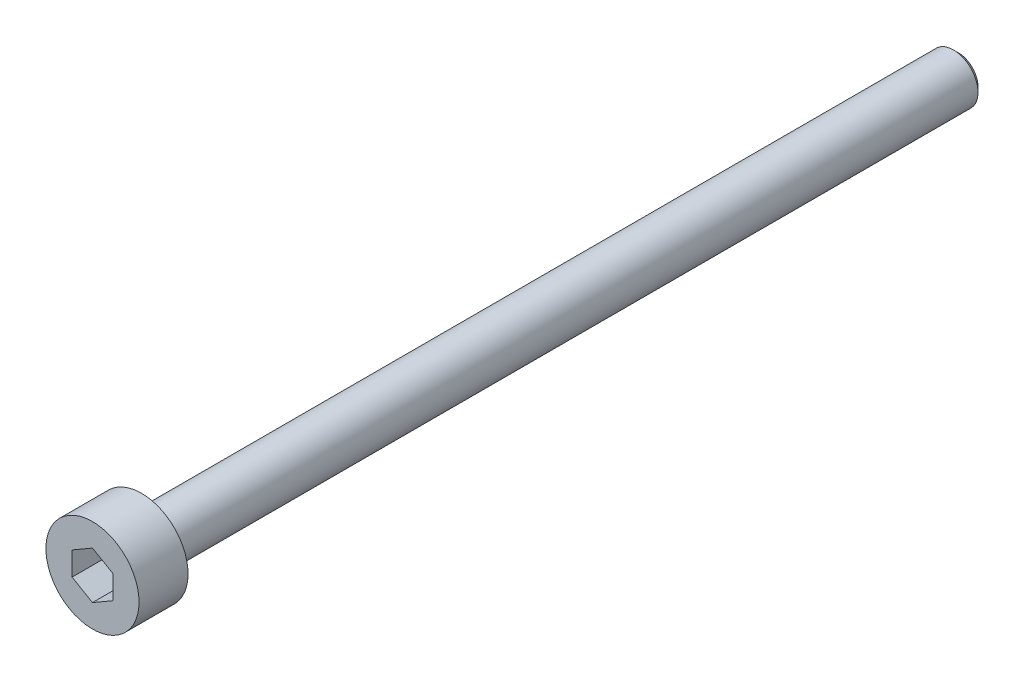
ISO-10303-21;
HEADER;
FILE_DESCRIPTION(('STEP AP214'),'2;1');
FILE_NAME('part.step','',(''),(''),'','','');
FILE_SCHEMA(('AUTOMOTIVE_DESIGN { 1 0 10303 214 1 1 1 1 }'));
ENDSEC;
DATA;
#1=APPLICATION_CONTEXT('core data for automotive mechanical design processes');
#2=APPLICATION_PROTOCOL_DEFINITION('international standard','automotive_design',2000,#1);
#3=PRODUCT_CONTEXT('',#1,'mechanical');
#4=PRODUCT('Part','Part','',(#3));
#5=PRODUCT_RELATED_PRODUCT_CATEGORY('part','',(#4));
#6=PRODUCT_DEFINITION_FORMATION('','',#4);
#7=PRODUCT_DEFINITION_CONTEXT('part definition',#1,'design');
#8=PRODUCT_DEFINITION('design','',#6,#7);
#9=PRODUCT_DEFINITION_SHAPE('','',#8);
#10=(LENGTH_UNIT() NAMED_UNIT(*) SI_UNIT(.MILLI.,.METRE.));
#11=(NAMED_UNIT(*) PLANE_ANGLE_UNIT() SI_UNIT($,.RADIAN.));
#12=(NAMED_UNIT(*) SI_UNIT($,.STERADIAN.) SOLID_ANGLE_UNIT());
#13=UNCERTAINTY_MEASURE_WITH_UNIT(LENGTH_MEASURE(1.E-05),#10,'distance_accuracy_value','');
#14=(GEOMETRIC_REPRESENTATION_CONTEXT(3) GLOBAL_UNCERTAINTY_ASSIGNED_CONTEXT((#13)) GLOBAL_UNIT_ASSIGNED_CONTEXT((#10,
#11,#12)) REPRESENTATION_CONTEXT('',''));
#15=CARTESIAN_POINT('',(0.,0.,0.));
#16=DIRECTION('',(0.,0.,1.));
#17=DIRECTION('',(1.,0.,0.));
#18=AXIS2_PLACEMENT_3D('',#15,#16,#17);
#19=CARTESIAN_POINT('',(0.,0.,0.));
#20=DIRECTION('',(0.,0.,1.));
#21=DIRECTION('',(1.,0.,0.));
#22=AXIS2_PLACEMENT_3D('',#19,#20,#21);
#23=PLANE('',#22);
#24=CARTESIAN_POINT('',(0.,0.,0.));
#25=DIRECTION('',(0.,0.,1.));
#26=DIRECTION('',(1.,0.,0.));
#27=AXIS2_PLACEMENT_3D('',#24,#25,#26);
#28=CIRCLE('',#27,2.85);
#29=CARTESIAN_POINT('',(2.85,0.,0.));
#30=VERTEX_POINT('',#29);
#31=EDGE_CURVE('E137',#30,#30,#28,.T.);
#32=ORIENTED_EDGE('',*,*,#31,.F.);
#33=EDGE_LOOP('',(#32));
#34=FACE_BOUND('',#33,.T.);
#35=CARTESIAN_POINT('',(0.,0.,0.));
#36=DIRECTION('',(0.,0.,1.));
#37=DIRECTION('',(1.,0.,0.));
#38=AXIS2_PLACEMENT_3D('',#35,#36,#37);
#39=CIRCLE('',#38,1.5);
#40=CARTESIAN_POINT('',(1.5,0.,0.));
#41=VERTEX_POINT('',#40);
#42=EDGE_CURVE('E146',#41,#41,#39,.F.);
#43=ORIENTED_EDGE('',*,*,#42,.F.);
#44=EDGE_LOOP('',(#43));
#45=FACE_BOUND('',#44,.T.);
#46=ADVANCED_FACE('F35',(#34,#45),#23,.F.);
#47=CARTESIAN_POINT('',(0.,0.,3.));
#48=DIRECTION('',(0.,0.,-1.));
#49=DIRECTION('',(-1.,0.,0.));
#50=AXIS2_PLACEMENT_3D('',#47,#48,#49);
#51=CYLINDRICAL_SURFACE('',#50,2.85);
#52=CARTESIAN_POINT('',(0.,0.,3.));
#53=DIRECTION('',(0.,0.,1.));
#54=DIRECTION('',(1.,0.,0.));
#55=AXIS2_PLACEMENT_3D('',#52,#53,#54);
#56=CIRCLE('',#55,2.85);
#57=CARTESIAN_POINT('',(2.85,0.,3.));
#58=VERTEX_POINT('',#57);
#59=EDGE_CURVE('E143',#58,#58,#56,.T.);
#60=ORIENTED_EDGE('',*,*,#59,.F.);
#61=EDGE_LOOP('',(#60));
#62=FACE_BOUND('',#61,.T.);
#63=ORIENTED_EDGE('',*,*,#31,.T.);
#64=EDGE_LOOP('',(#63));
#65=FACE_BOUND('',#64,.T.);
#66=ADVANCED_FACE('F168',(#62,#65),#51,.T.);
#67=CARTESIAN_POINT('',(0.,0.,3.));
#68=DIRECTION('',(0.,0.,1.));
#69=DIRECTION('',(1.,0.,0.));
#70=AXIS2_PLACEMENT_3D('',#67,#68,#69);
#71=PLANE('',#70);
#72=DIRECTION('',(-0.866025403784439,0.5,0.));
#73=VECTOR('',#72,1.);
#74=CARTESIAN_POINT('',(1.25,0.721687836487032,3.));
#75=LINE('',#74,#73);
#76=CARTESIAN_POINT('',(1.25,0.721687836487032,3.));
#77=VERTEX_POINT('',#76);
#78=CARTESIAN_POINT('',(0.,1.44337567297406,3.));
#79=VERTEX_POINT('',#78);
#80=EDGE_CURVE('E50',#77,#79,#75,.T.);
#81=ORIENTED_EDGE('',*,*,#80,.F.);
#82=DIRECTION('',(0.,1.,0.));
#83=VECTOR('',#82,1.);
#84=CARTESIAN_POINT('',(1.25,-0.721687836487032,3.));
#85=LINE('',#84,#83);
#86=CARTESIAN_POINT('',(1.25,-0.721687836487032,3.));
#87=VERTEX_POINT('',#86);
#88=EDGE_CURVE('E133',#87,#77,#85,.T.);
#89=ORIENTED_EDGE('',*,*,#88,.F.);
#90=DIRECTION('',(0.866025403784439,0.5,0.));
#91=VECTOR('',#90,1.);
#92=CARTESIAN_POINT('',(0.,-1.44337567297406,3.));
#93=LINE('',#92,#91);
#94=CARTESIAN_POINT('',(0.,-1.44337567297406,3.));
#95=VERTEX_POINT('',#94);
#96=EDGE_CURVE('E131',#95,#87,#93,.T.);
#97=ORIENTED_EDGE('',*,*,#96,.F.);
#98=DIRECTION('',(0.866025403784439,-0.5,0.));
#99=VECTOR('',#98,1.);
#100=CARTESIAN_POINT('',(-1.25,-0.721687836487033,3.));
#101=LINE('',#100,#99);
#102=CARTESIAN_POINT('',(-1.25,-0.721687836487033,3.));
#103=VERTEX_POINT('',#102);
#104=EDGE_CURVE('E98',#103,#95,#101,.T.);
#105=ORIENTED_EDGE('',*,*,#104,.F.);
#106=DIRECTION('',(0.,-1.,0.));
#107=VECTOR('',#106,1.);
#108=CARTESIAN_POINT('',(-1.25,0.721687836487032,3.));
#109=LINE('',#108,#107);
#110=CARTESIAN_POINT('',(-1.25,0.721687836487032,3.));
#111=VERTEX_POINT('',#110);
#112=EDGE_CURVE('E127',#111,#103,#109,.T.);
#113=ORIENTED_EDGE('',*,*,#112,.F.);
#114=DIRECTION('',(-0.866025403784439,-0.5,0.));
#115=VECTOR('',#114,1.);
#116=CARTESIAN_POINT('',(0.,1.44337567297406,3.));
#117=LINE('',#116,#115);
#118=EDGE_CURVE('E124',#79,#111,#117,.T.);
#119=ORIENTED_EDGE('',*,*,#118,.F.);
#120=EDGE_LOOP('',(#81,#89,#97,#105,#113,#119));
#121=FACE_BOUND('',#120,.T.);
#122=ORIENTED_EDGE('',*,*,#59,.T.);
#123=EDGE_LOOP('',(#122));
#124=FACE_BOUND('',#123,.T.);
#125=ADVANCED_FACE('F174',(#121,#124),#71,.T.);
#126=CARTESIAN_POINT('',(0.,0.,-50.));
#127=DIRECTION('',(0.,0.,1.));
#128=DIRECTION('',(1.,0.,0.));
#129=AXIS2_PLACEMENT_3D('',#126,#127,#128);
#130=CYLINDRICAL_SURFACE('',#129,1.5);
#131=CARTESIAN_POINT('',(0.,0.,-49.7));
#132=DIRECTION('',(0.,0.,-1.));
#133=DIRECTION('',(-1.,0.,0.));
#134=AXIS2_PLACEMENT_3D('',#131,#132,#133);
#135=CIRCLE('',#134,1.5);
#136=CARTESIAN_POINT('',(-1.5,0.,-49.7));
#137=VERTEX_POINT('',#136);
#138=EDGE_CURVE('E11',#137,#137,#135,.F.);
#139=ORIENTED_EDGE('',*,*,#138,.T.);
#140=EDGE_LOOP('',(#139));
#141=FACE_BOUND('',#140,.T.);
#142=ORIENTED_EDGE('',*,*,#42,.T.);
#143=EDGE_LOOP('',(#142));
#144=FACE_BOUND('',#143,.T.);
#145=ADVANCED_FACE('F164',(#141,#144),#130,.T.);
#146=CARTESIAN_POINT('',(0.,0.,-50.));
#147=DIRECTION('',(0.,0.,-1.));
#148=DIRECTION('',(-1.,0.,0.));
#149=AXIS2_PLACEMENT_3D('',#146,#147,#148);
#150=PLANE('',#149);
#151=CARTESIAN_POINT('',(0.,0.,-50.));
#152=DIRECTION('',(0.,0.,-1.));
#153=DIRECTION('',(-1.,0.,0.));
#154=AXIS2_PLACEMENT_3D('',#151,#152,#153);
#155=CIRCLE('',#154,1.2);
#156=CARTESIAN_POINT('',(-1.2,0.,-50.));
#157=VERTEX_POINT('',#156);
#158=EDGE_CURVE('E43',#157,#157,#155,.T.);
#159=ORIENTED_EDGE('',*,*,#158,.T.);
#160=EDGE_LOOP('',(#159));
#161=FACE_BOUND('',#160,.T.);
#162=ADVANCED_FACE('F153',(#161),#150,.T.);
#163=CARTESIAN_POINT('',(0.,0.,-50.));
#164=DIRECTION('',(0.,0.,1.));
#165=DIRECTION('',(1.,0.,0.));
#166=AXIS2_PLACEMENT_3D('',#163,#164,#165);
#167=CONICAL_SURFACE('',#166,1.2,0.785398163397447);
#168=ORIENTED_EDGE('',*,*,#138,.F.);
#169=EDGE_LOOP('',(#168));
#170=FACE_BOUND('',#169,.T.);
#171=ORIENTED_EDGE('',*,*,#158,.F.);
#172=EDGE_LOOP('',(#171));
#173=FACE_BOUND('',#172,.T.);
#174=ADVANCED_FACE('F37',(#170,#173),#167,.T.);
#175=CARTESIAN_POINT('',(1.25,0.721687836487032,1.));
#176=DIRECTION('',(0.5,0.866025403784439,0.));
#177=DIRECTION('',(-0.866025403784439,0.5,0.));
#178=AXIS2_PLACEMENT_3D('',#175,#176,#177);
#179=PLANE('',#178);
#180=ORIENTED_EDGE('',*,*,#80,.T.);
#181=DIRECTION('',(0.,0.,1.));
#182=VECTOR('',#181,1.);
#183=CARTESIAN_POINT('',(0.,1.44337567297406,1.));
#184=LINE('',#183,#182);
#185=CARTESIAN_POINT('',(0.,1.44337567297406,1.));
#186=VERTEX_POINT('',#185);
#187=EDGE_CURVE('E80',#186,#79,#184,.T.);
#188=ORIENTED_EDGE('',*,*,#187,.F.);
#189=DIRECTION('',(-0.866025403784439,0.5,0.));
#190=VECTOR('',#189,1.);
#191=CARTESIAN_POINT('',(1.25,0.721687836487032,1.));
#192=LINE('',#191,#190);
#193=CARTESIAN_POINT('',(1.25,0.721687836487032,1.));
#194=VERTEX_POINT('',#193);
#195=EDGE_CURVE('E135',#194,#186,#192,.T.);
#196=ORIENTED_EDGE('',*,*,#195,.F.);
#197=DIRECTION('',(0.,0.,1.));
#198=VECTOR('',#197,1.);
#199=CARTESIAN_POINT('',(1.25,0.721687836487032,1.));
#200=LINE('',#199,#198);
#201=EDGE_CURVE('E58',#194,#77,#200,.T.);
#202=ORIENTED_EDGE('',*,*,#201,.T.);
#203=EDGE_LOOP('',(#180,#188,#196,#202));
#204=FACE_BOUND('',#203,.T.);
#205=ADVANCED_FACE('F156',(#204),#179,.F.);
#206=CARTESIAN_POINT('',(1.25,-0.721687836487032,1.));
#207=DIRECTION('',(1.,0.,0.));
#208=DIRECTION('',(0.,1.,0.));
#209=AXIS2_PLACEMENT_3D('',#206,#207,#208);
#210=PLANE('',#209);
#211=ORIENTED_EDGE('',*,*,#88,.T.);
#212=ORIENTED_EDGE('',*,*,#201,.F.);
#213=DIRECTION('',(0.,1.,0.));
#214=VECTOR('',#213,1.);
#215=CARTESIAN_POINT('',(1.25,-0.721687836487032,1.));
#216=LINE('',#215,#214);
#217=CARTESIAN_POINT('',(1.25,-0.721687836487032,1.));
#218=VERTEX_POINT('',#217);
#219=EDGE_CURVE('E110',#218,#194,#216,.T.);
#220=ORIENTED_EDGE('',*,*,#219,.F.);
#221=DIRECTION('',(0.,0.,1.));
#222=VECTOR('',#221,1.);
#223=CARTESIAN_POINT('',(1.25,-0.721687836487032,1.));
#224=LINE('',#223,#222);
#225=EDGE_CURVE('E102',#218,#87,#224,.T.);
#226=ORIENTED_EDGE('',*,*,#225,.T.);
#227=EDGE_LOOP('',(#211,#212,#220,#226));
#228=FACE_BOUND('',#227,.T.);
#229=ADVANCED_FACE('F162',(#228),#210,.F.);
#230=CARTESIAN_POINT('',(0.,-1.44337567297406,1.));
#231=DIRECTION('',(0.5,-0.866025403784439,0.));
#232=DIRECTION('',(0.866025403784439,0.5,0.));
#233=AXIS2_PLACEMENT_3D('',#230,#231,#232);
#234=PLANE('',#233);
#235=ORIENTED_EDGE('',*,*,#96,.T.);
#236=ORIENTED_EDGE('',*,*,#225,.F.);
#237=DIRECTION('',(0.866025403784439,0.5,0.));
#238=VECTOR('',#237,1.);
#239=CARTESIAN_POINT('',(0.,-1.44337567297406,1.));
#240=LINE('',#239,#238);
#241=CARTESIAN_POINT('',(0.,-1.44337567297406,1.));
#242=VERTEX_POINT('',#241);
#243=EDGE_CURVE('E106',#242,#218,#240,.T.);
#244=ORIENTED_EDGE('',*,*,#243,.F.);
#245=DIRECTION('',(0.,0.,1.));
#246=VECTOR('',#245,1.);
#247=CARTESIAN_POINT('',(0.,-1.44337567297406,1.));
#248=LINE('',#247,#246);
#249=EDGE_CURVE('E91',#242,#95,#248,.T.);
#250=ORIENTED_EDGE('',*,*,#249,.T.);
#251=EDGE_LOOP('',(#235,#236,#244,#250));
#252=FACE_BOUND('',#251,.T.);
#253=ADVANCED_FACE('F107',(#252),#234,.F.);
#254=CARTESIAN_POINT('',(-1.25,-0.721687836487033,1.));
#255=DIRECTION('',(-0.5,-0.866025403784439,0.));
#256=DIRECTION('',(0.866025403784439,-0.5,0.));
#257=AXIS2_PLACEMENT_3D('',#254,#255,#256);
#258=PLANE('',#257);
#259=ORIENTED_EDGE('',*,*,#104,.T.);
#260=ORIENTED_EDGE('',*,*,#249,.F.);
#261=DIRECTION('',(0.866025403784439,-0.5,0.));
#262=VECTOR('',#261,1.);
#263=CARTESIAN_POINT('',(-1.25,-0.721687836487033,1.));
#264=LINE('',#263,#262);
#265=CARTESIAN_POINT('',(-1.25,-0.721687836487033,1.));
#266=VERTEX_POINT('',#265);
#267=EDGE_CURVE('E95',#266,#242,#264,.T.);
#268=ORIENTED_EDGE('',*,*,#267,.F.);
#269=DIRECTION('',(0.,0.,1.));
#270=VECTOR('',#269,1.);
#271=CARTESIAN_POINT('',(-1.25,-0.721687836487033,1.));
#272=LINE('',#271,#270);
#273=EDGE_CURVE('E103',#266,#103,#272,.T.);
#274=ORIENTED_EDGE('',*,*,#273,.T.);
#275=EDGE_LOOP('',(#259,#260,#268,#274));
#276=FACE_BOUND('',#275,.T.);
#277=ADVANCED_FACE('F93',(#276),#258,.F.);
#278=CARTESIAN_POINT('',(-1.25,0.721687836487032,1.));
#279=DIRECTION('',(-1.,0.,0.));
#280=DIRECTION('',(0.,0.,1.));
#281=AXIS2_PLACEMENT_3D('',#278,#279,#280);
#282=PLANE('',#281);
#283=ORIENTED_EDGE('',*,*,#112,.T.);
#284=ORIENTED_EDGE('',*,*,#273,.F.);
#285=DIRECTION('',(0.,-1.,0.));
#286=VECTOR('',#285,1.);
#287=CARTESIAN_POINT('',(-1.25,0.721687836487032,1.));
#288=LINE('',#287,#286);
#289=CARTESIAN_POINT('',(-1.25,0.721687836487032,1.));
#290=VERTEX_POINT('',#289);
#291=EDGE_CURVE('E116',#290,#266,#288,.T.);
#292=ORIENTED_EDGE('',*,*,#291,.F.);
#293=DIRECTION('',(0.,0.,1.));
#294=VECTOR('',#293,1.);
#295=CARTESIAN_POINT('',(-1.25,0.721687836487032,1.));
#296=LINE('',#295,#294);
#297=EDGE_CURVE('E140',#290,#111,#296,.T.);
#298=ORIENTED_EDGE('',*,*,#297,.T.);
#299=EDGE_LOOP('',(#283,#284,#292,#298));
#300=FACE_BOUND('',#299,.T.);
#301=ADVANCED_FACE('F188',(#300),#282,.F.);
#302=CARTESIAN_POINT('',(0.,1.44337567297406,1.));
#303=DIRECTION('',(-0.5,0.866025403784439,0.));
#304=DIRECTION('',(-0.866025403784439,-0.5,0.));
#305=AXIS2_PLACEMENT_3D('',#302,#303,#304);
#306=PLANE('',#305);
#307=ORIENTED_EDGE('',*,*,#118,.T.);
#308=ORIENTED_EDGE('',*,*,#297,.F.);
#309=DIRECTION('',(-0.866025403784439,-0.5,0.));
#310=VECTOR('',#309,1.);
#311=CARTESIAN_POINT('',(0.,1.44337567297406,1.));
#312=LINE('',#311,#310);
#313=EDGE_CURVE('E118',#186,#290,#312,.T.);
#314=ORIENTED_EDGE('',*,*,#313,.F.);
#315=ORIENTED_EDGE('',*,*,#187,.T.);
#316=EDGE_LOOP('',(#307,#308,#314,#315));
#317=FACE_BOUND('',#316,.T.);
#318=ADVANCED_FACE('F185',(#317),#306,.F.);
#319=CARTESIAN_POINT('',(0.,0.,1.));
#320=DIRECTION('',(0.,0.,1.));
#321=DIRECTION('',(1.,0.,0.));
#322=AXIS2_PLACEMENT_3D('',#319,#320,#321);
#323=PLANE('',#322);
#324=ORIENTED_EDGE('',*,*,#195,.T.);
#325=ORIENTED_EDGE('',*,*,#313,.T.);
#326=ORIENTED_EDGE('',*,*,#291,.T.);
#327=ORIENTED_EDGE('',*,*,#267,.T.);
#328=ORIENTED_EDGE('',*,*,#243,.T.);
#329=ORIENTED_EDGE('',*,*,#219,.T.);
#330=EDGE_LOOP('',(#324,#325,#326,#327,#328,#329));
#331=FACE_BOUND('',#330,.T.);
#332=ADVANCED_FACE('F113',(#331),#323,.T.);
#333=CLOSED_SHELL('',(#46,#66,#125,#145,#162,#174,#205,#229,#253,#277,#301,#318,#332));
#334=MANIFOLD_SOLID_BREP('B2',#333);
#335=ADVANCED_BREP_SHAPE_REPRESENTATION('',(#18,#334),#14);
#336=SHAPE_DEFINITION_REPRESENTATION(#9,#335);
ENDSEC;
END-ISO-10303-21;
